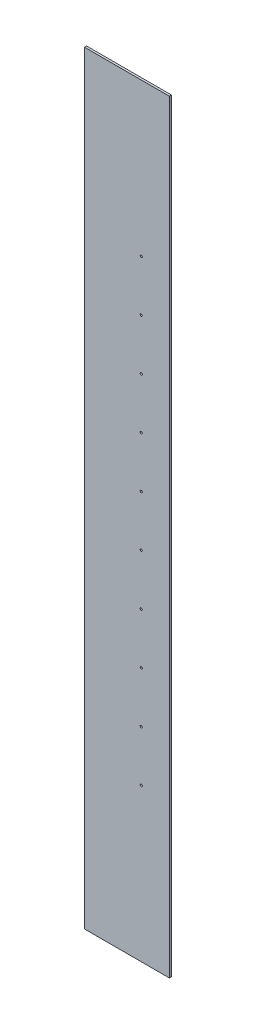
ISO-10303-21;
HEADER;
FILE_DESCRIPTION(('STEP AP214'),'2;1');
FILE_NAME('part.step','',(''),(''),'','','');
FILE_SCHEMA(('AUTOMOTIVE_DESIGN { 1 0 10303 214 1 1 1 1 }'));
ENDSEC;
DATA;
#1=APPLICATION_CONTEXT('core data for automotive mechanical design processes');
#2=APPLICATION_PROTOCOL_DEFINITION('international standard','automotive_design',2000,#1);
#3=PRODUCT_CONTEXT('',#1,'mechanical');
#4=PRODUCT('Part','Part','',(#3));
#5=PRODUCT_RELATED_PRODUCT_CATEGORY('part','',(#4));
#6=PRODUCT_DEFINITION_FORMATION('','',#4);
#7=PRODUCT_DEFINITION_CONTEXT('part definition',#1,'design');
#8=PRODUCT_DEFINITION('design','',#6,#7);
#9=PRODUCT_DEFINITION_SHAPE('','',#8);
#10=(LENGTH_UNIT() NAMED_UNIT(*) SI_UNIT(.MILLI.,.METRE.));
#11=(NAMED_UNIT(*) PLANE_ANGLE_UNIT() SI_UNIT($,.RADIAN.));
#12=(NAMED_UNIT(*) SI_UNIT($,.STERADIAN.) SOLID_ANGLE_UNIT());
#13=UNCERTAINTY_MEASURE_WITH_UNIT(LENGTH_MEASURE(1.E-05),#10,'distance_accuracy_value','');
#14=(GEOMETRIC_REPRESENTATION_CONTEXT(3) GLOBAL_UNCERTAINTY_ASSIGNED_CONTEXT((#13)) GLOBAL_UNIT_ASSIGNED_CONTEXT((#10,
#11,#12)) REPRESENTATION_CONTEXT('',''));
#15=CARTESIAN_POINT('',(0.,0.,0.));
#16=DIRECTION('',(0.,0.,1.));
#17=DIRECTION('',(1.,0.,0.));
#18=AXIS2_PLACEMENT_3D('',#15,#16,#17);
#19=CARTESIAN_POINT('',(0.,0.,5.));
#20=DIRECTION('',(0.,0.,1.));
#21=DIRECTION('',(1.,0.,0.));
#22=AXIS2_PLACEMENT_3D('',#19,#20,#21);
#23=PLANE('',#22);
#24=CARTESIAN_POINT('',(33.6999999999967,420.,5.));
#25=DIRECTION('',(0.,0.,1.));
#26=DIRECTION('',(1.,0.,0.));
#27=AXIS2_PLACEMENT_3D('',#24,#25,#26);
#28=CIRCLE('',#27,2.50000000000004);
#29=CARTESIAN_POINT('',(36.1999999999967,420.,5.));
#30=VERTEX_POINT('',#29);
#31=EDGE_CURVE('E157',#30,#30,#28,.T.);
#32=ORIENTED_EDGE('',*,*,#31,.F.);
#33=EDGE_LOOP('',(#32));
#34=FACE_BOUND('',#33,.T.);
#35=CARTESIAN_POINT('',(33.6999999999975,180.,5.));
#36=DIRECTION('',(0.,0.,1.));
#37=DIRECTION('',(1.,0.,0.));
#38=AXIS2_PLACEMENT_3D('',#35,#36,#37);
#39=CIRCLE('',#38,2.50000000000004);
#40=CARTESIAN_POINT('',(36.1999999999976,180.,5.));
#41=VERTEX_POINT('',#40);
#42=EDGE_CURVE('E145',#41,#41,#39,.T.);
#43=ORIENTED_EDGE('',*,*,#42,.F.);
#44=EDGE_LOOP('',(#43));
#45=FACE_BOUND('',#44,.T.);
#46=CARTESIAN_POINT('',(33.7,-540.,5.));
#47=DIRECTION('',(0.,0.,1.));
#48=DIRECTION('',(1.,0.,0.));
#49=AXIS2_PLACEMENT_3D('',#46,#47,#48);
#50=CIRCLE('',#49,2.50000000000004);
#51=CARTESIAN_POINT('',(36.2,-540.,5.));
#52=VERTEX_POINT('',#51);
#53=EDGE_CURVE('E133',#52,#52,#50,.T.);
#54=ORIENTED_EDGE('',*,*,#53,.F.);
#55=EDGE_LOOP('',(#54));
#56=FACE_BOUND('',#55,.T.);
#57=CARTESIAN_POINT('',(33.6999999999987,-180.,5.));
#58=DIRECTION('',(0.,0.,1.));
#59=DIRECTION('',(1.,0.,0.));
#60=AXIS2_PLACEMENT_3D('',#57,#58,#59);
#61=CIRCLE('',#60,2.50000000000004);
#62=CARTESIAN_POINT('',(36.1999999999988,-180.,5.));
#63=VERTEX_POINT('',#62);
#64=EDGE_CURVE('E121',#63,#63,#61,.T.);
#65=ORIENTED_EDGE('',*,*,#64,.F.);
#66=EDGE_LOOP('',(#65));
#67=FACE_BOUND('',#66,.T.);
#68=CARTESIAN_POINT('',(33.6999999999996,-420.,5.));
#69=DIRECTION('',(0.,0.,1.));
#70=DIRECTION('',(1.,0.,0.));
#71=AXIS2_PLACEMENT_3D('',#68,#69,#70);
#72=CIRCLE('',#71,2.50000000000004);
#73=CARTESIAN_POINT('',(36.1999999999996,-420.,5.));
#74=VERTEX_POINT('',#73);
#75=EDGE_CURVE('E100',#74,#74,#72,.T.);
#76=ORIENTED_EDGE('',*,*,#75,.F.);
#77=EDGE_LOOP('',(#76));
#78=FACE_BOUND('',#77,.T.);
#79=DIRECTION('',(0.,-1.,0.));
#80=VECTOR('',#79,1.);
#81=CARTESIAN_POINT('',(-100.,-900.,5.));
#82=LINE('',#81,#80);
#83=CARTESIAN_POINT('',(-100.,900.,5.));
#84=VERTEX_POINT('',#83);
#85=CARTESIAN_POINT('',(-100.,-900.,5.));
#86=VERTEX_POINT('',#85);
#87=EDGE_CURVE('E85',#84,#86,#82,.T.);
#88=ORIENTED_EDGE('',*,*,#87,.T.);
#89=DIRECTION('',(1.,0.,0.));
#90=VECTOR('',#89,1.);
#91=CARTESIAN_POINT('',(100.,-900.,5.));
#92=LINE('',#91,#90);
#93=CARTESIAN_POINT('',(100.,-900.,5.));
#94=VERTEX_POINT('',#93);
#95=EDGE_CURVE('E80',#86,#94,#92,.T.);
#96=ORIENTED_EDGE('',*,*,#95,.T.);
#97=DIRECTION('',(0.,1.,0.));
#98=VECTOR('',#97,1.);
#99=CARTESIAN_POINT('',(100.,-900.,5.));
#100=LINE('',#99,#98);
#101=CARTESIAN_POINT('',(100.,900.,5.));
#102=VERTEX_POINT('',#101);
#103=EDGE_CURVE('E83',#94,#102,#100,.T.);
#104=ORIENTED_EDGE('',*,*,#103,.T.);
#105=DIRECTION('',(-1.,0.,0.));
#106=VECTOR('',#105,1.);
#107=CARTESIAN_POINT('',(100.,900.,5.));
#108=LINE('',#107,#106);
#109=EDGE_CURVE('E50',#102,#84,#108,.T.);
#110=ORIENTED_EDGE('',*,*,#109,.T.);
#111=EDGE_LOOP('',(#88,#96,#104,#110));
#112=FACE_BOUND('',#111,.T.);
#113=CARTESIAN_POINT('',(33.6999999999992,-300.,5.));
#114=DIRECTION('',(0.,0.,1.));
#115=DIRECTION('',(1.,0.,0.));
#116=AXIS2_PLACEMENT_3D('',#113,#114,#115);
#117=CIRCLE('',#116,2.50000000000004);
#118=CARTESIAN_POINT('',(36.1999999999992,-300.,5.));
#119=VERTEX_POINT('',#118);
#120=EDGE_CURVE('E115',#119,#119,#117,.T.);
#121=ORIENTED_EDGE('',*,*,#120,.F.);
#122=EDGE_LOOP('',(#121));
#123=FACE_BOUND('',#122,.T.);
#124=CARTESIAN_POINT('',(33.6999999999983,-59.9999999999998,5.));
#125=DIRECTION('',(0.,0.,1.));
#126=DIRECTION('',(1.,0.,0.));
#127=AXIS2_PLACEMENT_3D('',#124,#125,#126);
#128=CIRCLE('',#127,2.50000000000005);
#129=CARTESIAN_POINT('',(36.1999999999984,-59.9999999999998,5.));
#130=VERTEX_POINT('',#129);
#131=EDGE_CURVE('E127',#130,#130,#128,.T.);
#132=ORIENTED_EDGE('',*,*,#131,.F.);
#133=EDGE_LOOP('',(#132));
#134=FACE_BOUND('',#133,.T.);
#135=CARTESIAN_POINT('',(33.6999999999979,60.0000000000002,5.));
#136=DIRECTION('',(0.,0.,1.));
#137=DIRECTION('',(1.,0.,0.));
#138=AXIS2_PLACEMENT_3D('',#135,#136,#137);
#139=CIRCLE('',#138,2.50000000000005);
#140=CARTESIAN_POINT('',(36.199999999998,60.0000000000002,5.));
#141=VERTEX_POINT('',#140);
#142=EDGE_CURVE('E139',#141,#141,#139,.T.);
#143=ORIENTED_EDGE('',*,*,#142,.F.);
#144=EDGE_LOOP('',(#143));
#145=FACE_BOUND('',#144,.T.);
#146=CARTESIAN_POINT('',(33.6999999999971,300.,5.));
#147=DIRECTION('',(0.,0.,1.));
#148=DIRECTION('',(1.,0.,0.));
#149=AXIS2_PLACEMENT_3D('',#146,#147,#148);
#150=CIRCLE('',#149,2.50000000000004);
#151=CARTESIAN_POINT('',(36.1999999999971,300.,5.));
#152=VERTEX_POINT('',#151);
#153=EDGE_CURVE('E151',#152,#152,#150,.T.);
#154=ORIENTED_EDGE('',*,*,#153,.F.);
#155=EDGE_LOOP('',(#154));
#156=FACE_BOUND('',#155,.T.);
#157=CARTESIAN_POINT('',(33.6999999999963,540.,5.));
#158=DIRECTION('',(0.,0.,1.));
#159=DIRECTION('',(1.,0.,0.));
#160=AXIS2_PLACEMENT_3D('',#157,#158,#159);
#161=CIRCLE('',#160,2.50000000000004);
#162=CARTESIAN_POINT('',(36.1999999999963,540.,5.));
#163=VERTEX_POINT('',#162);
#164=EDGE_CURVE('E163',#163,#163,#161,.T.);
#165=ORIENTED_EDGE('',*,*,#164,.F.);
#166=EDGE_LOOP('',(#165));
#167=FACE_BOUND('',#166,.T.);
#168=ADVANCED_FACE('F33',(#34,#45,#56,#67,#78,#112,#123,#134,#145,#156,#167),#23,.T.);
#169=CARTESIAN_POINT('',(0.,0.,0.));
#170=DIRECTION('',(0.,0.,1.));
#171=DIRECTION('',(1.,0.,0.));
#172=AXIS2_PLACEMENT_3D('',#169,#170,#171);
#173=PLANE('',#172);
#174=DIRECTION('',(0.,-1.,0.));
#175=VECTOR('',#174,1.);
#176=CARTESIAN_POINT('',(-100.,-900.,0.));
#177=LINE('',#176,#175);
#178=CARTESIAN_POINT('',(-100.,900.,0.));
#179=VERTEX_POINT('',#178);
#180=CARTESIAN_POINT('',(-100.,-900.,0.));
#181=VERTEX_POINT('',#180);
#182=EDGE_CURVE('E97',#179,#181,#177,.T.);
#183=ORIENTED_EDGE('',*,*,#182,.F.);
#184=DIRECTION('',(-1.,0.,0.));
#185=VECTOR('',#184,1.);
#186=CARTESIAN_POINT('',(100.,900.,0.));
#187=LINE('',#186,#185);
#188=CARTESIAN_POINT('',(100.,900.,0.));
#189=VERTEX_POINT('',#188);
#190=EDGE_CURVE('E73',#189,#179,#187,.T.);
#191=ORIENTED_EDGE('',*,*,#190,.F.);
#192=DIRECTION('',(0.,1.,0.));
#193=VECTOR('',#192,1.);
#194=CARTESIAN_POINT('',(100.,-900.,0.));
#195=LINE('',#194,#193);
#196=CARTESIAN_POINT('',(100.,-900.,0.));
#197=VERTEX_POINT('',#196);
#198=EDGE_CURVE('E67',#197,#189,#195,.T.);
#199=ORIENTED_EDGE('',*,*,#198,.F.);
#200=DIRECTION('',(1.,0.,0.));
#201=VECTOR('',#200,1.);
#202=CARTESIAN_POINT('',(100.,-900.,0.));
#203=LINE('',#202,#201);
#204=EDGE_CURVE('E89',#181,#197,#203,.T.);
#205=ORIENTED_EDGE('',*,*,#204,.F.);
#206=EDGE_LOOP('',(#183,#191,#199,#205));
#207=FACE_BOUND('',#206,.T.);
#208=CARTESIAN_POINT('',(33.6999999999996,-420.,0.));
#209=DIRECTION('',(0.,0.,1.));
#210=DIRECTION('',(1.,0.,0.));
#211=AXIS2_PLACEMENT_3D('',#208,#209,#210);
#212=CIRCLE('',#211,2.50000000000004);
#213=CARTESIAN_POINT('',(36.1999999999996,-420.,0.));
#214=VERTEX_POINT('',#213);
#215=EDGE_CURVE('E112',#214,#214,#212,.T.);
#216=ORIENTED_EDGE('',*,*,#215,.T.);
#217=EDGE_LOOP('',(#216));
#218=FACE_BOUND('',#217,.T.);
#219=CARTESIAN_POINT('',(33.6999999999992,-300.,0.));
#220=DIRECTION('',(0.,0.,1.));
#221=DIRECTION('',(1.,0.,0.));
#222=AXIS2_PLACEMENT_3D('',#219,#220,#221);
#223=CIRCLE('',#222,2.50000000000004);
#224=CARTESIAN_POINT('',(36.1999999999992,-300.,0.));
#225=VERTEX_POINT('',#224);
#226=EDGE_CURVE('E118',#225,#225,#223,.T.);
#227=ORIENTED_EDGE('',*,*,#226,.T.);
#228=EDGE_LOOP('',(#227));
#229=FACE_BOUND('',#228,.T.);
#230=CARTESIAN_POINT('',(33.6999999999987,-180.,0.));
#231=DIRECTION('',(0.,0.,1.));
#232=DIRECTION('',(1.,0.,0.));
#233=AXIS2_PLACEMENT_3D('',#230,#231,#232);
#234=CIRCLE('',#233,2.50000000000004);
#235=CARTESIAN_POINT('',(36.1999999999988,-180.,0.));
#236=VERTEX_POINT('',#235);
#237=EDGE_CURVE('E124',#236,#236,#234,.T.);
#238=ORIENTED_EDGE('',*,*,#237,.T.);
#239=EDGE_LOOP('',(#238));
#240=FACE_BOUND('',#239,.T.);
#241=CARTESIAN_POINT('',(33.6999999999983,-59.9999999999998,0.));
#242=DIRECTION('',(0.,0.,1.));
#243=DIRECTION('',(1.,0.,0.));
#244=AXIS2_PLACEMENT_3D('',#241,#242,#243);
#245=CIRCLE('',#244,2.50000000000005);
#246=CARTESIAN_POINT('',(36.1999999999984,-59.9999999999998,0.));
#247=VERTEX_POINT('',#246);
#248=EDGE_CURVE('E130',#247,#247,#245,.T.);
#249=ORIENTED_EDGE('',*,*,#248,.T.);
#250=EDGE_LOOP('',(#249));
#251=FACE_BOUND('',#250,.T.);
#252=CARTESIAN_POINT('',(33.7,-540.,0.));
#253=DIRECTION('',(0.,0.,1.));
#254=DIRECTION('',(1.,0.,0.));
#255=AXIS2_PLACEMENT_3D('',#252,#253,#254);
#256=CIRCLE('',#255,2.50000000000004);
#257=CARTESIAN_POINT('',(36.2,-540.,0.));
#258=VERTEX_POINT('',#257);
#259=EDGE_CURVE('E136',#258,#258,#256,.T.);
#260=ORIENTED_EDGE('',*,*,#259,.T.);
#261=EDGE_LOOP('',(#260));
#262=FACE_BOUND('',#261,.T.);
#263=CARTESIAN_POINT('',(33.6999999999979,60.0000000000002,0.));
#264=DIRECTION('',(0.,0.,1.));
#265=DIRECTION('',(1.,0.,0.));
#266=AXIS2_PLACEMENT_3D('',#263,#264,#265);
#267=CIRCLE('',#266,2.50000000000005);
#268=CARTESIAN_POINT('',(36.199999999998,60.0000000000002,0.));
#269=VERTEX_POINT('',#268);
#270=EDGE_CURVE('E142',#269,#269,#267,.T.);
#271=ORIENTED_EDGE('',*,*,#270,.T.);
#272=EDGE_LOOP('',(#271));
#273=FACE_BOUND('',#272,.T.);
#274=CARTESIAN_POINT('',(33.6999999999975,180.,0.));
#275=DIRECTION('',(0.,0.,1.));
#276=DIRECTION('',(1.,0.,0.));
#277=AXIS2_PLACEMENT_3D('',#274,#275,#276);
#278=CIRCLE('',#277,2.50000000000004);
#279=CARTESIAN_POINT('',(36.1999999999976,180.,0.));
#280=VERTEX_POINT('',#279);
#281=EDGE_CURVE('E148',#280,#280,#278,.T.);
#282=ORIENTED_EDGE('',*,*,#281,.T.);
#283=EDGE_LOOP('',(#282));
#284=FACE_BOUND('',#283,.T.);
#285=CARTESIAN_POINT('',(33.6999999999971,300.,0.));
#286=DIRECTION('',(0.,0.,1.));
#287=DIRECTION('',(1.,0.,0.));
#288=AXIS2_PLACEMENT_3D('',#285,#286,#287);
#289=CIRCLE('',#288,2.50000000000004);
#290=CARTESIAN_POINT('',(36.1999999999971,300.,0.));
#291=VERTEX_POINT('',#290);
#292=EDGE_CURVE('E154',#291,#291,#289,.T.);
#293=ORIENTED_EDGE('',*,*,#292,.T.);
#294=EDGE_LOOP('',(#293));
#295=FACE_BOUND('',#294,.T.);
#296=CARTESIAN_POINT('',(33.6999999999967,420.,0.));
#297=DIRECTION('',(0.,0.,1.));
#298=DIRECTION('',(1.,0.,0.));
#299=AXIS2_PLACEMENT_3D('',#296,#297,#298);
#300=CIRCLE('',#299,2.50000000000004);
#301=CARTESIAN_POINT('',(36.1999999999967,420.,0.));
#302=VERTEX_POINT('',#301);
#303=EDGE_CURVE('E160',#302,#302,#300,.T.);
#304=ORIENTED_EDGE('',*,*,#303,.T.);
#305=EDGE_LOOP('',(#304));
#306=FACE_BOUND('',#305,.T.);
#307=CARTESIAN_POINT('',(33.6999999999963,540.,0.));
#308=DIRECTION('',(0.,0.,1.));
#309=DIRECTION('',(1.,0.,0.));
#310=AXIS2_PLACEMENT_3D('',#307,#308,#309);
#311=CIRCLE('',#310,2.50000000000004);
#312=CARTESIAN_POINT('',(36.1999999999963,540.,0.));
#313=VERTEX_POINT('',#312);
#314=EDGE_CURVE('E166',#313,#313,#311,.T.);
#315=ORIENTED_EDGE('',*,*,#314,.T.);
#316=EDGE_LOOP('',(#315));
#317=FACE_BOUND('',#316,.T.);
#318=ADVANCED_FACE('F108',(#207,#218,#229,#240,#251,#262,#273,#284,#295,#306,#317),#173,.F.);
#319=CARTESIAN_POINT('',(-100.,-900.,5.));
#320=DIRECTION('',(1.,0.,0.));
#321=DIRECTION('',(0.,0.,-1.));
#322=AXIS2_PLACEMENT_3D('',#319,#320,#321);
#323=PLANE('',#322);
#324=ORIENTED_EDGE('',*,*,#182,.T.);
#325=DIRECTION('',(0.,0.,-1.));
#326=VECTOR('',#325,1.);
#327=CARTESIAN_POINT('',(-100.,-900.,5.));
#328=LINE('',#327,#326);
#329=EDGE_CURVE('E11',#86,#181,#328,.T.);
#330=ORIENTED_EDGE('',*,*,#329,.F.);
#331=ORIENTED_EDGE('',*,*,#87,.F.);
#332=DIRECTION('',(0.,0.,-1.));
#333=VECTOR('',#332,1.);
#334=CARTESIAN_POINT('',(-100.,900.,5.));
#335=LINE('',#334,#333);
#336=EDGE_CURVE('E93',#84,#179,#335,.T.);
#337=ORIENTED_EDGE('',*,*,#336,.T.);
#338=EDGE_LOOP('',(#324,#330,#331,#337));
#339=FACE_BOUND('',#338,.T.);
#340=ADVANCED_FACE('F35',(#339),#323,.F.);
#341=CARTESIAN_POINT('',(100.,-900.,5.));
#342=DIRECTION('',(0.,1.,0.));
#343=DIRECTION('',(0.,0.,1.));
#344=AXIS2_PLACEMENT_3D('',#341,#342,#343);
#345=PLANE('',#344);
#346=ORIENTED_EDGE('',*,*,#204,.T.);
#347=DIRECTION('',(0.,0.,-1.));
#348=VECTOR('',#347,1.);
#349=CARTESIAN_POINT('',(100.,-900.,5.));
#350=LINE('',#349,#348);
#351=EDGE_CURVE('E42',#94,#197,#350,.T.);
#352=ORIENTED_EDGE('',*,*,#351,.F.);
#353=ORIENTED_EDGE('',*,*,#95,.F.);
#354=ORIENTED_EDGE('',*,*,#329,.T.);
#355=EDGE_LOOP('',(#346,#352,#353,#354));
#356=FACE_BOUND('',#355,.T.);
#357=ADVANCED_FACE('F88',(#356),#345,.F.);
#358=CARTESIAN_POINT('',(100.,-900.,5.));
#359=DIRECTION('',(-1.,0.,0.));
#360=DIRECTION('',(0.,0.,1.));
#361=AXIS2_PLACEMENT_3D('',#358,#359,#360);
#362=PLANE('',#361);
#363=ORIENTED_EDGE('',*,*,#198,.T.);
#364=DIRECTION('',(0.,0.,-1.));
#365=VECTOR('',#364,1.);
#366=CARTESIAN_POINT('',(100.,900.,5.));
#367=LINE('',#366,#365);
#368=EDGE_CURVE('E90',#102,#189,#367,.T.);
#369=ORIENTED_EDGE('',*,*,#368,.F.);
#370=ORIENTED_EDGE('',*,*,#103,.F.);
#371=ORIENTED_EDGE('',*,*,#351,.T.);
#372=EDGE_LOOP('',(#363,#369,#370,#371));
#373=FACE_BOUND('',#372,.T.);
#374=ADVANCED_FACE('F91',(#373),#362,.F.);
#375=CARTESIAN_POINT('',(100.,900.,5.));
#376=DIRECTION('',(0.,-1.,0.));
#377=DIRECTION('',(0.,0.,-1.));
#378=AXIS2_PLACEMENT_3D('',#375,#376,#377);
#379=PLANE('',#378);
#380=ORIENTED_EDGE('',*,*,#190,.T.);
#381=ORIENTED_EDGE('',*,*,#336,.F.);
#382=ORIENTED_EDGE('',*,*,#109,.F.);
#383=ORIENTED_EDGE('',*,*,#368,.T.);
#384=EDGE_LOOP('',(#380,#381,#382,#383));
#385=FACE_BOUND('',#384,.T.);
#386=ADVANCED_FACE('F105',(#385),#379,.F.);
#387=CARTESIAN_POINT('',(33.6999999999996,-420.,5.));
#388=DIRECTION('',(0.,0.,-1.));
#389=DIRECTION('',(-1.,0.,0.));
#390=AXIS2_PLACEMENT_3D('',#387,#388,#389);
#391=CYLINDRICAL_SURFACE('',#390,2.50000000000004);
#392=ORIENTED_EDGE('',*,*,#75,.T.);
#393=EDGE_LOOP('',(#392));
#394=FACE_BOUND('',#393,.T.);
#395=ORIENTED_EDGE('',*,*,#215,.F.);
#396=EDGE_LOOP('',(#395));
#397=FACE_BOUND('',#396,.T.);
#398=ADVANCED_FACE('F185',(#394,#397),#391,.F.);
#399=CARTESIAN_POINT('',(33.6999999999992,-300.,5.));
#400=DIRECTION('',(0.,0.,-1.));
#401=DIRECTION('',(-1.,0.,0.));
#402=AXIS2_PLACEMENT_3D('',#399,#400,#401);
#403=CYLINDRICAL_SURFACE('',#402,2.50000000000004);
#404=ORIENTED_EDGE('',*,*,#120,.T.);
#405=EDGE_LOOP('',(#404));
#406=FACE_BOUND('',#405,.T.);
#407=ORIENTED_EDGE('',*,*,#226,.F.);
#408=EDGE_LOOP('',(#407));
#409=FACE_BOUND('',#408,.T.);
#410=ADVANCED_FACE('F231',(#406,#409),#403,.F.);
#411=CARTESIAN_POINT('',(33.6999999999987,-180.,5.));
#412=DIRECTION('',(0.,0.,-1.));
#413=DIRECTION('',(-1.,0.,0.));
#414=AXIS2_PLACEMENT_3D('',#411,#412,#413);
#415=CYLINDRICAL_SURFACE('',#414,2.50000000000004);
#416=ORIENTED_EDGE('',*,*,#64,.T.);
#417=EDGE_LOOP('',(#416));
#418=FACE_BOUND('',#417,.T.);
#419=ORIENTED_EDGE('',*,*,#237,.F.);
#420=EDGE_LOOP('',(#419));
#421=FACE_BOUND('',#420,.T.);
#422=ADVANCED_FACE('F239',(#418,#421),#415,.F.);
#423=CARTESIAN_POINT('',(33.6999999999983,-59.9999999999998,5.));
#424=DIRECTION('',(0.,0.,-1.));
#425=DIRECTION('',(-1.,0.,0.));
#426=AXIS2_PLACEMENT_3D('',#423,#424,#425);
#427=CYLINDRICAL_SURFACE('',#426,2.50000000000005);
#428=ORIENTED_EDGE('',*,*,#131,.T.);
#429=EDGE_LOOP('',(#428));
#430=FACE_BOUND('',#429,.T.);
#431=ORIENTED_EDGE('',*,*,#248,.F.);
#432=EDGE_LOOP('',(#431));
#433=FACE_BOUND('',#432,.T.);
#434=ADVANCED_FACE('F247',(#430,#433),#427,.F.);
#435=CARTESIAN_POINT('',(33.7,-540.,5.));
#436=DIRECTION('',(0.,0.,-1.));
#437=DIRECTION('',(-1.,0.,0.));
#438=AXIS2_PLACEMENT_3D('',#435,#436,#437);
#439=CYLINDRICAL_SURFACE('',#438,2.50000000000004);
#440=ORIENTED_EDGE('',*,*,#53,.T.);
#441=EDGE_LOOP('',(#440));
#442=FACE_BOUND('',#441,.T.);
#443=ORIENTED_EDGE('',*,*,#259,.F.);
#444=EDGE_LOOP('',(#443));
#445=FACE_BOUND('',#444,.T.);
#446=ADVANCED_FACE('F256',(#442,#445),#439,.F.);
#447=CARTESIAN_POINT('',(33.6999999999979,60.0000000000002,5.));
#448=DIRECTION('',(0.,0.,-1.));
#449=DIRECTION('',(-1.,0.,0.));
#450=AXIS2_PLACEMENT_3D('',#447,#448,#449);
#451=CYLINDRICAL_SURFACE('',#450,2.50000000000005);
#452=ORIENTED_EDGE('',*,*,#142,.T.);
#453=EDGE_LOOP('',(#452));
#454=FACE_BOUND('',#453,.T.);
#455=ORIENTED_EDGE('',*,*,#270,.F.);
#456=EDGE_LOOP('',(#455));
#457=FACE_BOUND('',#456,.T.);
#458=ADVANCED_FACE('F265',(#454,#457),#451,.F.);
#459=CARTESIAN_POINT('',(33.6999999999975,180.,5.));
#460=DIRECTION('',(0.,0.,-1.));
#461=DIRECTION('',(-1.,0.,0.));
#462=AXIS2_PLACEMENT_3D('',#459,#460,#461);
#463=CYLINDRICAL_SURFACE('',#462,2.50000000000004);
#464=ORIENTED_EDGE('',*,*,#42,.T.);
#465=EDGE_LOOP('',(#464));
#466=FACE_BOUND('',#465,.T.);
#467=ORIENTED_EDGE('',*,*,#281,.F.);
#468=EDGE_LOOP('',(#467));
#469=FACE_BOUND('',#468,.T.);
#470=ADVANCED_FACE('F274',(#466,#469),#463,.F.);
#471=CARTESIAN_POINT('',(33.6999999999971,300.,5.));
#472=DIRECTION('',(0.,0.,-1.));
#473=DIRECTION('',(-1.,0.,0.));
#474=AXIS2_PLACEMENT_3D('',#471,#472,#473);
#475=CYLINDRICAL_SURFACE('',#474,2.50000000000004);
#476=ORIENTED_EDGE('',*,*,#153,.T.);
#477=EDGE_LOOP('',(#476));
#478=FACE_BOUND('',#477,.T.);
#479=ORIENTED_EDGE('',*,*,#292,.F.);
#480=EDGE_LOOP('',(#479));
#481=FACE_BOUND('',#480,.T.);
#482=ADVANCED_FACE('F283',(#478,#481),#475,.F.);
#483=CARTESIAN_POINT('',(33.6999999999967,420.,5.));
#484=DIRECTION('',(0.,0.,-1.));
#485=DIRECTION('',(-1.,0.,0.));
#486=AXIS2_PLACEMENT_3D('',#483,#484,#485);
#487=CYLINDRICAL_SURFACE('',#486,2.50000000000004);
#488=ORIENTED_EDGE('',*,*,#31,.T.);
#489=EDGE_LOOP('',(#488));
#490=FACE_BOUND('',#489,.T.);
#491=ORIENTED_EDGE('',*,*,#303,.F.);
#492=EDGE_LOOP('',(#491));
#493=FACE_BOUND('',#492,.T.);
#494=ADVANCED_FACE('F292',(#490,#493),#487,.F.);
#495=CARTESIAN_POINT('',(33.6999999999963,540.,5.));
#496=DIRECTION('',(0.,0.,-1.));
#497=DIRECTION('',(-1.,0.,0.));
#498=AXIS2_PLACEMENT_3D('',#495,#496,#497);
#499=CYLINDRICAL_SURFACE('',#498,2.50000000000004);
#500=ORIENTED_EDGE('',*,*,#164,.T.);
#501=EDGE_LOOP('',(#500));
#502=FACE_BOUND('',#501,.T.);
#503=ORIENTED_EDGE('',*,*,#314,.F.);
#504=EDGE_LOOP('',(#503));
#505=FACE_BOUND('',#504,.T.);
#506=ADVANCED_FACE('F172',(#502,#505),#499,.F.);
#507=CLOSED_SHELL('',(#168,#318,#340,#357,#374,#386,#398,#410,#422,#434,#446,#458,#470,#482,
#494,#506));
#508=MANIFOLD_SOLID_BREP('B2',#507);
#509=ADVANCED_BREP_SHAPE_REPRESENTATION('',(#18,#508),#14);
#510=SHAPE_DEFINITION_REPRESENTATION(#9,#509);
ENDSEC;
END-ISO-10303-21;
